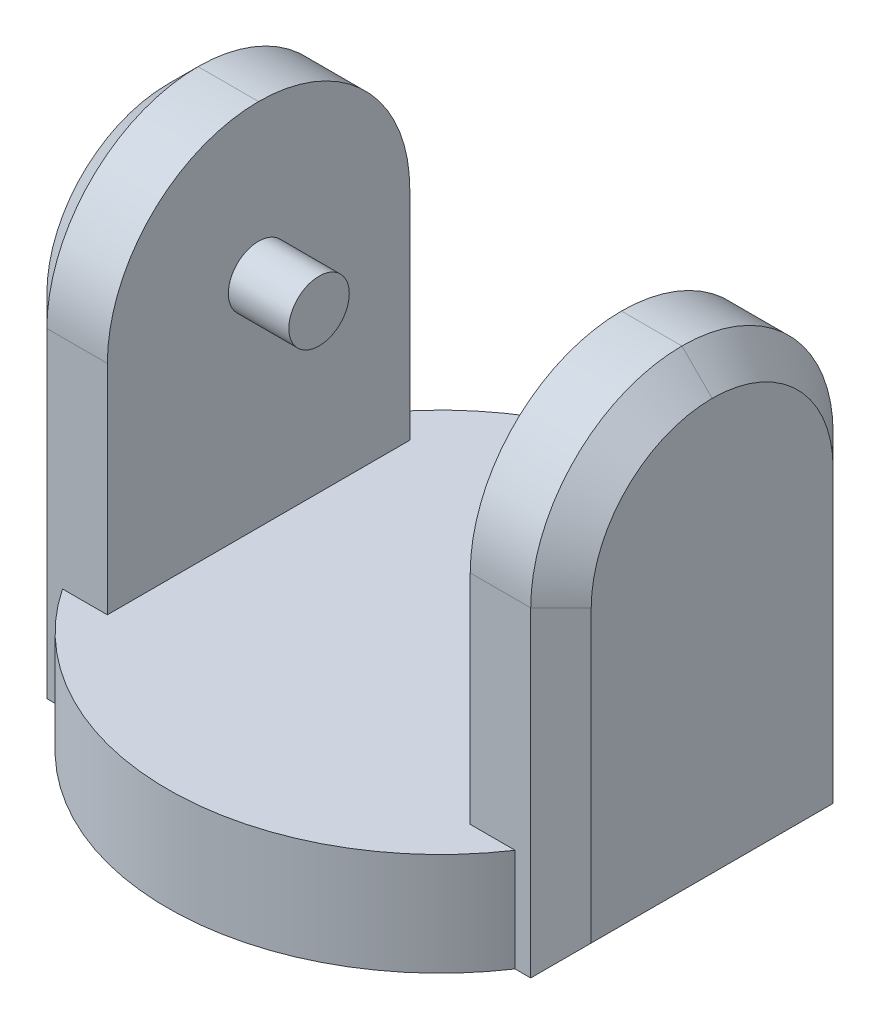
ISO-10303-21;
HEADER;
FILE_DESCRIPTION(('STEP AP214'),'2;1');
FILE_NAME('part.step','',(''),(''),'','','');
FILE_SCHEMA(('AUTOMOTIVE_DESIGN { 1 0 10303 214 1 1 1 1 }'));
ENDSEC;
DATA;
#1=APPLICATION_CONTEXT('core data for automotive mechanical design processes');
#2=APPLICATION_PROTOCOL_DEFINITION('international standard','automotive_design',2000,#1);
#3=PRODUCT_CONTEXT('',#1,'mechanical');
#4=PRODUCT('Part','Part','',(#3));
#5=PRODUCT_RELATED_PRODUCT_CATEGORY('part','',(#4));
#6=PRODUCT_DEFINITION_FORMATION('','',#4);
#7=PRODUCT_DEFINITION_CONTEXT('part definition',#1,'design');
#8=PRODUCT_DEFINITION('design','',#6,#7);
#9=PRODUCT_DEFINITION_SHAPE('','',#8);
#10=(LENGTH_UNIT() NAMED_UNIT(*) SI_UNIT(.MILLI.,.METRE.));
#11=(NAMED_UNIT(*) PLANE_ANGLE_UNIT() SI_UNIT($,.RADIAN.));
#12=(NAMED_UNIT(*) SI_UNIT($,.STERADIAN.) SOLID_ANGLE_UNIT());
#13=UNCERTAINTY_MEASURE_WITH_UNIT(LENGTH_MEASURE(1.E-05),#10,'distance_accuracy_value','');
#14=(GEOMETRIC_REPRESENTATION_CONTEXT(3) GLOBAL_UNCERTAINTY_ASSIGNED_CONTEXT((#13)) GLOBAL_UNIT_ASSIGNED_CONTEXT((#10,
#11,#12)) REPRESENTATION_CONTEXT('',''));
#15=CARTESIAN_POINT('',(0.,0.,0.));
#16=DIRECTION('',(0.,0.,1.));
#17=DIRECTION('',(1.,0.,0.));
#18=AXIS2_PLACEMENT_3D('',#15,#16,#17);
#19=CARTESIAN_POINT('',(0.,17.,0.));
#20=DIRECTION('',(0.,-1.,0.));
#21=DIRECTION('',(0.,0.,-1.));
#22=AXIS2_PLACEMENT_3D('',#19,#20,#21);
#23=CYLINDRICAL_SURFACE('',#22,45.);
#24=DIRECTION('',(0.,-1.,0.));
#25=VECTOR('',#24,1.);
#26=CARTESIAN_POINT('',(-37.4165738677394,17.,25.));
#27=LINE('',#26,#25);
#28=CARTESIAN_POINT('',(-37.4165738677394,0.,25.));
#29=VERTEX_POINT('',#28);
#30=CARTESIAN_POINT('',(-37.4165738677394,17.,25.));
#31=VERTEX_POINT('',#30);
#32=EDGE_CURVE('E205',#29,#31,#27,.F.);
#33=ORIENTED_EDGE('',*,*,#32,.F.);
#34=CARTESIAN_POINT('',(0.,0.,0.));
#35=DIRECTION('',(0.,1.,0.));
#36=DIRECTION('',(0.,0.,1.));
#37=AXIS2_PLACEMENT_3D('',#34,#35,#36);
#38=CIRCLE('',#37,45.);
#39=CARTESIAN_POINT('',(37.4165738677394,0.,25.));
#40=VERTEX_POINT('',#39);
#41=EDGE_CURVE('E231',#29,#40,#38,.T.);
#42=ORIENTED_EDGE('',*,*,#41,.T.);
#43=DIRECTION('',(0.,-1.,0.));
#44=VECTOR('',#43,1.);
#45=CARTESIAN_POINT('',(37.4165738677394,17.,25.));
#46=LINE('',#45,#44);
#47=CARTESIAN_POINT('',(37.4165738677394,17.,25.));
#48=VERTEX_POINT('',#47);
#49=EDGE_CURVE('E228',#40,#48,#46,.F.);
#50=ORIENTED_EDGE('',*,*,#49,.T.);
#51=CARTESIAN_POINT('',(0.,17.,0.));
#52=DIRECTION('',(0.,1.,0.));
#53=DIRECTION('',(0.,0.,1.));
#54=AXIS2_PLACEMENT_3D('',#51,#52,#53);
#55=CIRCLE('',#54,45.);
#56=EDGE_CURVE('E234',#31,#48,#55,.T.);
#57=ORIENTED_EDGE('',*,*,#56,.F.);
#58=EDGE_LOOP('',(#33,#42,#50,#57));
#59=FACE_BOUND('',#58,.T.);
#60=ADVANCED_FACE('F39',(#59),#23,.T.);
#61=DIRECTION('',(0.,-1.,0.));
#62=VECTOR('',#61,1.);
#63=CARTESIAN_POINT('',(-37.4165738677394,17.,-25.));
#64=LINE('',#63,#62);
#65=CARTESIAN_POINT('',(-37.4165738677394,17.,-25.));
#66=VERTEX_POINT('',#65);
#67=CARTESIAN_POINT('',(-37.4165738677394,0.,-25.));
#68=VERTEX_POINT('',#67);
#69=EDGE_CURVE('E198',#66,#68,#64,.T.);
#70=ORIENTED_EDGE('',*,*,#69,.F.);
#71=CARTESIAN_POINT('',(37.4165738677394,17.,-25.));
#72=VERTEX_POINT('',#71);
#73=EDGE_CURVE('E197',#72,#66,#55,.T.);
#74=ORIENTED_EDGE('',*,*,#73,.F.);
#75=DIRECTION('',(0.,-1.,0.));
#76=VECTOR('',#75,1.);
#77=CARTESIAN_POINT('',(37.4165738677394,17.,-25.));
#78=LINE('',#77,#76);
#79=CARTESIAN_POINT('',(37.4165738677394,0.,-25.));
#80=VERTEX_POINT('',#79);
#81=EDGE_CURVE('E223',#72,#80,#78,.T.);
#82=ORIENTED_EDGE('',*,*,#81,.T.);
#83=EDGE_CURVE('E235',#80,#68,#38,.T.);
#84=ORIENTED_EDGE('',*,*,#83,.T.);
#85=EDGE_LOOP('',(#70,#74,#82,#84));
#86=FACE_BOUND('',#85,.T.);
#87=ADVANCED_FACE('F435',(#86),#23,.T.);
#88=CARTESIAN_POINT('',(0.,17.,0.));
#89=DIRECTION('',(0.,1.,0.));
#90=DIRECTION('',(0.,0.,1.));
#91=AXIS2_PLACEMENT_3D('',#88,#89,#90);
#92=PLANE('',#91);
#93=DIRECTION('',(0.,0.,1.));
#94=VECTOR('',#93,1.);
#95=CARTESIAN_POINT('',(-30.,17.,0.));
#96=LINE('',#95,#94);
#97=CARTESIAN_POINT('',(-30.,17.,-25.));
#98=VERTEX_POINT('',#97);
#99=CARTESIAN_POINT('',(-30.,17.,25.));
#100=VERTEX_POINT('',#99);
#101=EDGE_CURVE('E172',#98,#100,#96,.T.);
#102=ORIENTED_EDGE('',*,*,#101,.T.);
#103=DIRECTION('',(-1.,0.,0.));
#104=VECTOR('',#103,1.);
#105=CARTESIAN_POINT('',(0.,17.,25.));
#106=LINE('',#105,#104);
#107=EDGE_CURVE('E200',#100,#31,#106,.T.);
#108=ORIENTED_EDGE('',*,*,#107,.T.);
#109=ORIENTED_EDGE('',*,*,#56,.T.);
#110=DIRECTION('',(1.,0.,0.));
#111=VECTOR('',#110,1.);
#112=CARTESIAN_POINT('',(0.,17.,25.));
#113=LINE('',#112,#111);
#114=CARTESIAN_POINT('',(30.,17.,25.));
#115=VERTEX_POINT('',#114);
#116=EDGE_CURVE('E225',#115,#48,#113,.T.);
#117=ORIENTED_EDGE('',*,*,#116,.F.);
#118=DIRECTION('',(0.,0.,1.));
#119=VECTOR('',#118,1.);
#120=CARTESIAN_POINT('',(30.,17.,0.));
#121=LINE('',#120,#119);
#122=CARTESIAN_POINT('',(30.,17.,-25.));
#123=VERTEX_POINT('',#122);
#124=EDGE_CURVE('E216',#123,#115,#121,.T.);
#125=ORIENTED_EDGE('',*,*,#124,.F.);
#126=DIRECTION('',(-1.,0.,0.));
#127=VECTOR('',#126,1.);
#128=CARTESIAN_POINT('',(0.,17.,-25.));
#129=LINE('',#128,#127);
#130=EDGE_CURVE('E220',#72,#123,#129,.T.);
#131=ORIENTED_EDGE('',*,*,#130,.F.);
#132=ORIENTED_EDGE('',*,*,#73,.T.);
#133=DIRECTION('',(1.,0.,0.));
#134=VECTOR('',#133,1.);
#135=CARTESIAN_POINT('',(0.,17.,-25.));
#136=LINE('',#135,#134);
#137=EDGE_CURVE('E183',#66,#98,#136,.T.);
#138=ORIENTED_EDGE('',*,*,#137,.T.);
#139=EDGE_LOOP('',(#102,#108,#109,#117,#125,#131,#132,#138));
#140=FACE_BOUND('',#139,.T.);
#141=ADVANCED_FACE('F195',(#140),#92,.T.);
#142=CARTESIAN_POINT('',(0.,0.,0.));
#143=DIRECTION('',(0.,1.,0.));
#144=DIRECTION('',(0.,0.,1.));
#145=AXIS2_PLACEMENT_3D('',#142,#143,#144);
#146=PLANE('',#145);
#147=CARTESIAN_POINT('',(0.,0.,0.));
#148=DIRECTION('',(0.,-1.,0.));
#149=DIRECTION('',(0.,0.,-1.));
#150=AXIS2_PLACEMENT_3D('',#147,#148,#149);
#151=CIRCLE('',#150,5.);
#152=CARTESIAN_POINT('',(0.,0.,-5.));
#153=VERTEX_POINT('',#152);
#154=EDGE_CURVE('E411',#153,#153,#151,.T.);
#155=ORIENTED_EDGE('',*,*,#154,.F.);
#156=EDGE_LOOP('',(#155));
#157=FACE_BOUND('',#156,.T.);
#158=DIRECTION('',(-1.,0.,0.));
#159=VECTOR('',#158,1.);
#160=CARTESIAN_POINT('',(-30.,0.,25.));
#161=LINE('',#160,#159);
#162=CARTESIAN_POINT('',(-40.,0.,25.));
#163=VERTEX_POINT('',#162);
#164=EDGE_CURVE('E184',#29,#163,#161,.T.);
#165=ORIENTED_EDGE('',*,*,#164,.T.);
#166=DIRECTION('',(0.,0.,-1.));
#167=VECTOR('',#166,1.);
#168=CARTESIAN_POINT('',(-40.,0.,-25.));
#169=LINE('',#168,#167);
#170=CARTESIAN_POINT('',(-40.,0.,-25.));
#171=VERTEX_POINT('',#170);
#172=EDGE_CURVE('E262',#163,#171,#169,.T.);
#173=ORIENTED_EDGE('',*,*,#172,.T.);
#174=DIRECTION('',(-1.,0.,0.));
#175=VECTOR('',#174,1.);
#176=CARTESIAN_POINT('',(-30.,0.,-25.));
#177=LINE('',#176,#175);
#178=EDGE_CURVE('E192',#68,#171,#177,.T.);
#179=ORIENTED_EDGE('',*,*,#178,.F.);
#180=ORIENTED_EDGE('',*,*,#83,.F.);
#181=DIRECTION('',(1.,0.,0.));
#182=VECTOR('',#181,1.);
#183=CARTESIAN_POINT('',(30.,0.,-25.));
#184=LINE('',#183,#182);
#185=CARTESIAN_POINT('',(40.,0.,-25.));
#186=VERTEX_POINT('',#185);
#187=EDGE_CURVE('E213',#80,#186,#184,.T.);
#188=ORIENTED_EDGE('',*,*,#187,.T.);
#189=DIRECTION('',(0.,0.,1.));
#190=VECTOR('',#189,1.);
#191=CARTESIAN_POINT('',(40.,0.,0.));
#192=LINE('',#191,#190);
#193=CARTESIAN_POINT('',(40.,0.,25.));
#194=VERTEX_POINT('',#193);
#195=EDGE_CURVE('E254',#186,#194,#192,.T.);
#196=ORIENTED_EDGE('',*,*,#195,.T.);
#197=DIRECTION('',(1.,0.,0.));
#198=VECTOR('',#197,1.);
#199=CARTESIAN_POINT('',(30.,0.,25.));
#200=LINE('',#199,#198);
#201=EDGE_CURVE('E212',#40,#194,#200,.T.);
#202=ORIENTED_EDGE('',*,*,#201,.F.);
#203=ORIENTED_EDGE('',*,*,#41,.F.);
#204=EDGE_LOOP('',(#165,#173,#179,#180,#188,#196,#202,#203));
#205=FACE_BOUND('',#204,.T.);
#206=ADVANCED_FACE('F361',(#157,#205),#146,.F.);
#207=CARTESIAN_POINT('',(30.,0.,25.));
#208=DIRECTION('',(0.,0.,1.));
#209=DIRECTION('',(1.,0.,0.));
#210=AXIS2_PLACEMENT_3D('',#207,#208,#209);
#211=PLANE('',#210);
#212=ORIENTED_EDGE('',*,*,#201,.T.);
#213=DIRECTION('',(0.,1.,0.));
#214=VECTOR('',#213,1.);
#215=CARTESIAN_POINT('',(40.,53.,25.));
#216=LINE('',#215,#214);
#217=CARTESIAN_POINT('',(40.,53.,25.));
#218=VERTEX_POINT('',#217);
#219=EDGE_CURVE('E48',#194,#218,#216,.T.);
#220=ORIENTED_EDGE('',*,*,#219,.T.);
#221=DIRECTION('',(1.,0.,0.));
#222=VECTOR('',#221,1.);
#223=CARTESIAN_POINT('',(30.,53.,25.));
#224=LINE('',#223,#222);
#225=CARTESIAN_POINT('',(30.,53.,25.));
#226=VERTEX_POINT('',#225);
#227=EDGE_CURVE('E244',#218,#226,#224,.F.);
#228=ORIENTED_EDGE('',*,*,#227,.T.);
#229=DIRECTION('',(0.,-1.,0.));
#230=VECTOR('',#229,1.);
#231=CARTESIAN_POINT('',(30.,0.,25.));
#232=LINE('',#231,#230);
#233=EDGE_CURVE('E207',#226,#115,#232,.T.);
#234=ORIENTED_EDGE('',*,*,#233,.T.);
#235=ORIENTED_EDGE('',*,*,#116,.T.);
#236=ORIENTED_EDGE('',*,*,#49,.F.);
#237=EDGE_LOOP('',(#212,#220,#228,#234,#235,#236));
#238=FACE_BOUND('',#237,.T.);
#239=ADVANCED_FACE('F365',(#238),#211,.T.);
#240=CARTESIAN_POINT('',(30.,0.,-25.));
#241=DIRECTION('',(0.,0.,-1.));
#242=DIRECTION('',(-1.,0.,0.));
#243=AXIS2_PLACEMENT_3D('',#240,#241,#242);
#244=PLANE('',#243);
#245=DIRECTION('',(1.,0.,0.));
#246=VECTOR('',#245,1.);
#247=CARTESIAN_POINT('',(30.,53.,-25.));
#248=LINE('',#247,#246);
#249=CARTESIAN_POINT('',(30.,53.,-25.));
#250=VERTEX_POINT('',#249);
#251=CARTESIAN_POINT('',(40.,53.,-25.));
#252=VERTEX_POINT('',#251);
#253=EDGE_CURVE('E233',#250,#252,#248,.T.);
#254=ORIENTED_EDGE('',*,*,#253,.T.);
#255=DIRECTION('',(0.,-1.,0.));
#256=VECTOR('',#255,1.);
#257=CARTESIAN_POINT('',(40.,0.,-25.));
#258=LINE('',#257,#256);
#259=EDGE_CURVE('E295',#252,#186,#258,.T.);
#260=ORIENTED_EDGE('',*,*,#259,.T.);
#261=ORIENTED_EDGE('',*,*,#187,.F.);
#262=ORIENTED_EDGE('',*,*,#81,.F.);
#263=ORIENTED_EDGE('',*,*,#130,.T.);
#264=DIRECTION('',(0.,1.,0.));
#265=VECTOR('',#264,1.);
#266=CARTESIAN_POINT('',(30.,0.,-25.));
#267=LINE('',#266,#265);
#268=EDGE_CURVE('E209',#123,#250,#267,.T.);
#269=ORIENTED_EDGE('',*,*,#268,.T.);
#270=EDGE_LOOP('',(#254,#260,#261,#262,#263,#269));
#271=FACE_BOUND('',#270,.T.);
#272=ADVANCED_FACE('F350',(#271),#244,.T.);
#273=CARTESIAN_POINT('',(30.,0.,0.));
#274=DIRECTION('',(-1.,0.,0.));
#275=DIRECTION('',(0.,0.,1.));
#276=AXIS2_PLACEMENT_3D('',#273,#274,#275);
#277=PLANE('',#276);
#278=CARTESIAN_POINT('',(30.,53.,0.));
#279=DIRECTION('',(-1.,0.,0.));
#280=DIRECTION('',(0.,0.,1.));
#281=AXIS2_PLACEMENT_3D('',#278,#279,#280);
#282=CIRCLE('',#281,25.);
#283=CARTESIAN_POINT('',(30.,78.,0.));
#284=VERTEX_POINT('',#283);
#285=EDGE_CURVE('E240',#226,#284,#282,.T.);
#286=ORIENTED_EDGE('',*,*,#285,.T.);
#287=CARTESIAN_POINT('',(30.,53.,0.));
#288=DIRECTION('',(-1.,0.,0.));
#289=DIRECTION('',(0.,0.,1.));
#290=AXIS2_PLACEMENT_3D('',#287,#288,#289);
#291=CIRCLE('',#290,25.);
#292=EDGE_CURVE('E242',#284,#250,#291,.T.);
#293=ORIENTED_EDGE('',*,*,#292,.T.);
#294=ORIENTED_EDGE('',*,*,#268,.F.);
#295=ORIENTED_EDGE('',*,*,#124,.T.);
#296=ORIENTED_EDGE('',*,*,#233,.F.);
#297=EDGE_LOOP('',(#286,#293,#294,#295,#296));
#298=FACE_BOUND('',#297,.T.);
#299=ADVANCED_FACE('F576',(#298),#277,.T.);
#300=CARTESIAN_POINT('',(45.,0.,0.));
#301=DIRECTION('',(-1.,0.,0.));
#302=DIRECTION('',(0.,0.,1.));
#303=AXIS2_PLACEMENT_3D('',#300,#301,#302);
#304=PLANE('',#303);
#305=DIRECTION('',(0.,0.,-1.));
#306=VECTOR('',#305,1.);
#307=CARTESIAN_POINT('',(45.,4.99999999999999,0.));
#308=LINE('',#307,#306);
#309=CARTESIAN_POINT('',(45.,4.99999999999999,20.));
#310=VERTEX_POINT('',#309);
#311=CARTESIAN_POINT('',(45.,4.99999999999999,-20.));
#312=VERTEX_POINT('',#311);
#313=EDGE_CURVE('E286',#310,#312,#308,.T.);
#314=ORIENTED_EDGE('',*,*,#313,.T.);
#315=DIRECTION('',(0.,1.,0.));
#316=VECTOR('',#315,1.);
#317=CARTESIAN_POINT('',(45.,53.,-20.));
#318=LINE('',#317,#316);
#319=CARTESIAN_POINT('',(45.,53.,-20.));
#320=VERTEX_POINT('',#319);
#321=EDGE_CURVE('E292',#312,#320,#318,.T.);
#322=ORIENTED_EDGE('',*,*,#321,.T.);
#323=CARTESIAN_POINT('',(45.,53.,0.));
#324=DIRECTION('',(-1.,0.,0.));
#325=DIRECTION('',(0.,0.,1.));
#326=AXIS2_PLACEMENT_3D('',#323,#324,#325);
#327=CIRCLE('',#326,20.);
#328=CARTESIAN_POINT('',(45.,73.,0.));
#329=VERTEX_POINT('',#328);
#330=EDGE_CURVE('E290',#320,#329,#327,.F.);
#331=ORIENTED_EDGE('',*,*,#330,.T.);
#332=CARTESIAN_POINT('',(45.,53.,0.));
#333=DIRECTION('',(-1.,0.,0.));
#334=DIRECTION('',(0.,0.,1.));
#335=AXIS2_PLACEMENT_3D('',#332,#333,#334);
#336=CIRCLE('',#335,20.);
#337=CARTESIAN_POINT('',(45.,53.,20.));
#338=VERTEX_POINT('',#337);
#339=EDGE_CURVE('E288',#329,#338,#336,.F.);
#340=ORIENTED_EDGE('',*,*,#339,.T.);
#341=DIRECTION('',(0.,-1.,0.));
#342=VECTOR('',#341,1.);
#343=CARTESIAN_POINT('',(45.,0.,20.));
#344=LINE('',#343,#342);
#345=EDGE_CURVE('E284',#338,#310,#344,.T.);
#346=ORIENTED_EDGE('',*,*,#345,.T.);
#347=EDGE_LOOP('',(#314,#322,#331,#340,#346));
#348=FACE_BOUND('',#347,.T.);
#349=ADVANCED_FACE('F336',(#348),#304,.F.);
#350=CARTESIAN_POINT('',(-30.,0.,25.));
#351=DIRECTION('',(0.,0.,-1.));
#352=DIRECTION('',(-1.,0.,0.));
#353=AXIS2_PLACEMENT_3D('',#350,#351,#352);
#354=PLANE('',#353);
#355=DIRECTION('',(-1.,0.,0.));
#356=VECTOR('',#355,1.);
#357=CARTESIAN_POINT('',(-30.,53.,25.));
#358=LINE('',#357,#356);
#359=CARTESIAN_POINT('',(-30.,53.,25.));
#360=VERTEX_POINT('',#359);
#361=CARTESIAN_POINT('',(-40.,53.,25.));
#362=VERTEX_POINT('',#361);
#363=EDGE_CURVE('E246',#360,#362,#358,.T.);
#364=ORIENTED_EDGE('',*,*,#363,.T.);
#365=DIRECTION('',(0.,-1.,0.));
#366=VECTOR('',#365,1.);
#367=CARTESIAN_POINT('',(-40.,0.,25.));
#368=LINE('',#367,#366);
#369=EDGE_CURVE('E278',#362,#163,#368,.T.);
#370=ORIENTED_EDGE('',*,*,#369,.T.);
#371=ORIENTED_EDGE('',*,*,#164,.F.);
#372=ORIENTED_EDGE('',*,*,#32,.T.);
#373=ORIENTED_EDGE('',*,*,#107,.F.);
#374=DIRECTION('',(0.,-1.,0.));
#375=VECTOR('',#374,1.);
#376=CARTESIAN_POINT('',(-30.,0.,25.));
#377=LINE('',#376,#375);
#378=EDGE_CURVE('E178',#360,#100,#377,.T.);
#379=ORIENTED_EDGE('',*,*,#378,.F.);
#380=EDGE_LOOP('',(#364,#370,#371,#372,#373,#379));
#381=FACE_BOUND('',#380,.T.);
#382=ADVANCED_FACE('F404',(#381),#354,.F.);
#383=CARTESIAN_POINT('',(-30.,0.,-25.));
#384=DIRECTION('',(0.,0.,1.));
#385=DIRECTION('',(1.,0.,0.));
#386=AXIS2_PLACEMENT_3D('',#383,#384,#385);
#387=PLANE('',#386);
#388=ORIENTED_EDGE('',*,*,#178,.T.);
#389=DIRECTION('',(0.,1.,0.));
#390=VECTOR('',#389,1.);
#391=CARTESIAN_POINT('',(-40.,53.,-25.));
#392=LINE('',#391,#390);
#393=CARTESIAN_POINT('',(-40.,53.,-25.));
#394=VERTEX_POINT('',#393);
#395=EDGE_CURVE('E276',#171,#394,#392,.T.);
#396=ORIENTED_EDGE('',*,*,#395,.T.);
#397=DIRECTION('',(-1.,0.,0.));
#398=VECTOR('',#397,1.);
#399=CARTESIAN_POINT('',(-30.,53.,-25.));
#400=LINE('',#399,#398);
#401=CARTESIAN_POINT('',(-30.,53.,-25.));
#402=VERTEX_POINT('',#401);
#403=EDGE_CURVE('E191',#394,#402,#400,.F.);
#404=ORIENTED_EDGE('',*,*,#403,.T.);
#405=DIRECTION('',(0.,1.,0.));
#406=VECTOR('',#405,1.);
#407=CARTESIAN_POINT('',(-30.,0.,-25.));
#408=LINE('',#407,#406);
#409=EDGE_CURVE('E175',#98,#402,#408,.T.);
#410=ORIENTED_EDGE('',*,*,#409,.F.);
#411=ORIENTED_EDGE('',*,*,#137,.F.);
#412=ORIENTED_EDGE('',*,*,#69,.T.);
#413=EDGE_LOOP('',(#388,#396,#404,#410,#411,#412));
#414=FACE_BOUND('',#413,.T.);
#415=ADVANCED_FACE('F188',(#414),#387,.F.);
#416=CARTESIAN_POINT('',(-30.,0.,0.));
#417=DIRECTION('',(-1.,0.,0.));
#418=DIRECTION('',(0.,0.,1.));
#419=AXIS2_PLACEMENT_3D('',#416,#417,#418);
#420=PLANE('',#419);
#421=CARTESIAN_POINT('',(-30.,53.,0.));
#422=DIRECTION('',(-1.,0.,0.));
#423=DIRECTION('',(0.,0.,1.));
#424=AXIS2_PLACEMENT_3D('',#421,#422,#423);
#425=CIRCLE('',#424,5.);
#426=CARTESIAN_POINT('',(-30.,53.,5.));
#427=VERTEX_POINT('',#426);
#428=EDGE_CURVE('E11',#427,#427,#425,.F.);
#429=ORIENTED_EDGE('',*,*,#428,.F.);
#430=EDGE_LOOP('',(#429));
#431=FACE_BOUND('',#430,.T.);
#432=CARTESIAN_POINT('',(-30.,53.,0.));
#433=DIRECTION('',(-1.,0.,0.));
#434=DIRECTION('',(0.,0.,1.));
#435=AXIS2_PLACEMENT_3D('',#432,#433,#434);
#436=CIRCLE('',#435,25.);
#437=CARTESIAN_POINT('',(-30.,78.,0.));
#438=VERTEX_POINT('',#437);
#439=EDGE_CURVE('E249',#402,#438,#436,.F.);
#440=ORIENTED_EDGE('',*,*,#439,.T.);
#441=CARTESIAN_POINT('',(-30.,53.,0.));
#442=DIRECTION('',(-1.,0.,0.));
#443=DIRECTION('',(0.,0.,1.));
#444=AXIS2_PLACEMENT_3D('',#441,#442,#443);
#445=CIRCLE('',#444,25.);
#446=EDGE_CURVE('E251',#438,#360,#445,.F.);
#447=ORIENTED_EDGE('',*,*,#446,.T.);
#448=ORIENTED_EDGE('',*,*,#378,.T.);
#449=ORIENTED_EDGE('',*,*,#101,.F.);
#450=ORIENTED_EDGE('',*,*,#409,.T.);
#451=EDGE_LOOP('',(#440,#447,#448,#449,#450));
#452=FACE_BOUND('',#451,.T.);
#453=ADVANCED_FACE('F174',(#431,#452),#420,.F.);
#454=CARTESIAN_POINT('',(-45.,0.,0.));
#455=DIRECTION('',(-1.,0.,0.));
#456=DIRECTION('',(0.,0.,1.));
#457=AXIS2_PLACEMENT_3D('',#454,#455,#456);
#458=PLANE('',#457);
#459=DIRECTION('',(0.,-1.,0.));
#460=VECTOR('',#459,1.);
#461=CARTESIAN_POINT('',(-45.,0.,-20.));
#462=LINE('',#461,#460);
#463=CARTESIAN_POINT('',(-45.,53.,-20.));
#464=VERTEX_POINT('',#463);
#465=CARTESIAN_POINT('',(-45.,5.,-20.));
#466=VERTEX_POINT('',#465);
#467=EDGE_CURVE('E271',#464,#466,#462,.T.);
#468=ORIENTED_EDGE('',*,*,#467,.T.);
#469=DIRECTION('',(0.,0.,1.));
#470=VECTOR('',#469,1.);
#471=CARTESIAN_POINT('',(-45.,5.,25.));
#472=LINE('',#471,#470);
#473=CARTESIAN_POINT('',(-45.,5.,20.));
#474=VERTEX_POINT('',#473);
#475=EDGE_CURVE('E273',#466,#474,#472,.T.);
#476=ORIENTED_EDGE('',*,*,#475,.T.);
#477=DIRECTION('',(0.,1.,0.));
#478=VECTOR('',#477,1.);
#479=CARTESIAN_POINT('',(-45.,53.,20.));
#480=LINE('',#479,#478);
#481=CARTESIAN_POINT('',(-45.,53.,20.));
#482=VERTEX_POINT('',#481);
#483=EDGE_CURVE('E269',#474,#482,#480,.T.);
#484=ORIENTED_EDGE('',*,*,#483,.T.);
#485=CARTESIAN_POINT('',(-45.,53.,0.));
#486=DIRECTION('',(-1.,0.,0.));
#487=DIRECTION('',(0.,0.,1.));
#488=AXIS2_PLACEMENT_3D('',#485,#486,#487);
#489=CIRCLE('',#488,20.);
#490=CARTESIAN_POINT('',(-45.,73.,0.));
#491=VERTEX_POINT('',#490);
#492=EDGE_CURVE('E265',#482,#491,#489,.T.);
#493=ORIENTED_EDGE('',*,*,#492,.T.);
#494=CARTESIAN_POINT('',(-45.,53.,0.));
#495=DIRECTION('',(-1.,0.,0.));
#496=DIRECTION('',(0.,0.,1.));
#497=AXIS2_PLACEMENT_3D('',#494,#495,#496);
#498=CIRCLE('',#497,20.);
#499=EDGE_CURVE('E267',#491,#464,#498,.T.);
#500=ORIENTED_EDGE('',*,*,#499,.T.);
#501=EDGE_LOOP('',(#468,#476,#484,#493,#500));
#502=FACE_BOUND('',#501,.T.);
#503=ADVANCED_FACE('F449',(#502),#458,.T.);
#504=CARTESIAN_POINT('',(30.,53.,0.));
#505=DIRECTION('',(1.,0.,0.));
#506=DIRECTION('',(0.,0.,-1.));
#507=AXIS2_PLACEMENT_3D('',#504,#505,#506);
#508=CYLINDRICAL_SURFACE('',#507,25.);
#509=ORIENTED_EDGE('',*,*,#227,.F.);
#510=CARTESIAN_POINT('',(40.,53.,0.));
#511=DIRECTION('',(-1.,0.,0.));
#512=DIRECTION('',(0.,0.,1.));
#513=AXIS2_PLACEMENT_3D('',#510,#511,#512);
#514=CIRCLE('',#513,25.);
#515=CARTESIAN_POINT('',(40.,78.,0.));
#516=VERTEX_POINT('',#515);
#517=EDGE_CURVE('E61',#218,#516,#514,.T.);
#518=ORIENTED_EDGE('',*,*,#517,.T.);
#519=DIRECTION('',(1.,0.,0.));
#520=VECTOR('',#519,1.);
#521=CARTESIAN_POINT('',(30.,78.,0.));
#522=LINE('',#521,#520);
#523=EDGE_CURVE('E255',#284,#516,#522,.T.);
#524=ORIENTED_EDGE('',*,*,#523,.F.);
#525=ORIENTED_EDGE('',*,*,#285,.F.);
#526=EDGE_LOOP('',(#509,#518,#524,#525));
#527=FACE_BOUND('',#526,.T.);
#528=ADVANCED_FACE('F446',(#527),#508,.T.);
#529=CARTESIAN_POINT('',(30.,53.,0.));
#530=DIRECTION('',(1.,0.,0.));
#531=DIRECTION('',(0.,0.,-1.));
#532=AXIS2_PLACEMENT_3D('',#529,#530,#531);
#533=CYLINDRICAL_SURFACE('',#532,25.);
#534=ORIENTED_EDGE('',*,*,#523,.T.);
#535=CARTESIAN_POINT('',(40.,53.,0.));
#536=DIRECTION('',(-1.,0.,0.));
#537=DIRECTION('',(0.,0.,1.));
#538=AXIS2_PLACEMENT_3D('',#535,#536,#537);
#539=CIRCLE('',#538,25.);
#540=EDGE_CURVE('E298',#516,#252,#539,.T.);
#541=ORIENTED_EDGE('',*,*,#540,.T.);
#542=ORIENTED_EDGE('',*,*,#253,.F.);
#543=ORIENTED_EDGE('',*,*,#292,.F.);
#544=EDGE_LOOP('',(#534,#541,#542,#543));
#545=FACE_BOUND('',#544,.T.);
#546=ADVANCED_FACE('F346',(#545),#533,.T.);
#547=CARTESIAN_POINT('',(-30.,53.,0.));
#548=DIRECTION('',(-1.,0.,0.));
#549=DIRECTION('',(0.,0.,1.));
#550=AXIS2_PLACEMENT_3D('',#547,#548,#549);
#551=CYLINDRICAL_SURFACE('',#550,25.);
#552=ORIENTED_EDGE('',*,*,#403,.F.);
#553=CARTESIAN_POINT('',(-40.,53.,0.));
#554=DIRECTION('',(-1.,0.,0.));
#555=DIRECTION('',(0.,0.,1.));
#556=AXIS2_PLACEMENT_3D('',#553,#554,#555);
#557=CIRCLE('',#556,25.);
#558=CARTESIAN_POINT('',(-40.,78.,0.));
#559=VERTEX_POINT('',#558);
#560=EDGE_CURVE('E280',#394,#559,#557,.F.);
#561=ORIENTED_EDGE('',*,*,#560,.T.);
#562=DIRECTION('',(-1.,0.,0.));
#563=VECTOR('',#562,1.);
#564=CARTESIAN_POINT('',(-30.,78.,0.));
#565=LINE('',#564,#563);
#566=EDGE_CURVE('E257',#438,#559,#565,.T.);
#567=ORIENTED_EDGE('',*,*,#566,.F.);
#568=ORIENTED_EDGE('',*,*,#439,.F.);
#569=EDGE_LOOP('',(#552,#561,#567,#568));
#570=FACE_BOUND('',#569,.T.);
#571=ADVANCED_FACE('F389',(#570),#551,.T.);
#572=CARTESIAN_POINT('',(-30.,53.,0.));
#573=DIRECTION('',(-1.,0.,0.));
#574=DIRECTION('',(0.,0.,1.));
#575=AXIS2_PLACEMENT_3D('',#572,#573,#574);
#576=CYLINDRICAL_SURFACE('',#575,25.);
#577=ORIENTED_EDGE('',*,*,#566,.T.);
#578=CARTESIAN_POINT('',(-40.,53.,0.));
#579=DIRECTION('',(-1.,0.,0.));
#580=DIRECTION('',(0.,0.,1.));
#581=AXIS2_PLACEMENT_3D('',#578,#579,#580);
#582=CIRCLE('',#581,25.);
#583=EDGE_CURVE('E282',#559,#362,#582,.F.);
#584=ORIENTED_EDGE('',*,*,#583,.T.);
#585=ORIENTED_EDGE('',*,*,#363,.F.);
#586=ORIENTED_EDGE('',*,*,#446,.F.);
#587=EDGE_LOOP('',(#577,#584,#585,#586));
#588=FACE_BOUND('',#587,.T.);
#589=ADVANCED_FACE('F402',(#588),#576,.T.);
#590=CARTESIAN_POINT('',(-45.,53.,0.));
#591=DIRECTION('',(1.,0.,0.));
#592=DIRECTION('',(0.,0.,-1.));
#593=AXIS2_PLACEMENT_3D('',#590,#591,#592);
#594=CONICAL_SURFACE('',#593,20.,0.785398163397445);
#595=DIRECTION('',(-0.70710678118655,0.,-0.707106781186545));
#596=VECTOR('',#595,1.);
#597=CARTESIAN_POINT('',(-40.,53.,25.));
#598=LINE('',#597,#596);
#599=EDGE_CURVE('E310',#362,#482,#598,.T.);
#600=ORIENTED_EDGE('',*,*,#599,.F.);
#601=ORIENTED_EDGE('',*,*,#583,.F.);
#602=DIRECTION('',(0.70710678118655,0.707106781186545,0.));
#603=VECTOR('',#602,1.);
#604=CARTESIAN_POINT('',(-45.,73.,0.));
#605=LINE('',#604,#603);
#606=EDGE_CURVE('E260',#491,#559,#605,.T.);
#607=ORIENTED_EDGE('',*,*,#606,.F.);
#608=ORIENTED_EDGE('',*,*,#492,.F.);
#609=EDGE_LOOP('',(#600,#601,#607,#608));
#610=FACE_BOUND('',#609,.T.);
#611=ADVANCED_FACE('F399',(#610),#594,.T.);
#612=CARTESIAN_POINT('',(-45.,53.,0.));
#613=DIRECTION('',(1.,0.,0.));
#614=DIRECTION('',(0.,0.,-1.));
#615=AXIS2_PLACEMENT_3D('',#612,#613,#614);
#616=CONICAL_SURFACE('',#615,20.,0.785398163397444);
#617=ORIENTED_EDGE('',*,*,#606,.T.);
#618=ORIENTED_EDGE('',*,*,#560,.F.);
#619=DIRECTION('',(0.70710678118655,0.,-0.707106781186545));
#620=VECTOR('',#619,1.);
#621=CARTESIAN_POINT('',(-45.,53.,-20.));
#622=LINE('',#621,#620);
#623=EDGE_CURVE('E307',#464,#394,#622,.T.);
#624=ORIENTED_EDGE('',*,*,#623,.F.);
#625=ORIENTED_EDGE('',*,*,#499,.F.);
#626=EDGE_LOOP('',(#617,#618,#624,#625));
#627=FACE_BOUND('',#626,.T.);
#628=ADVANCED_FACE('F392',(#627),#616,.T.);
#629=CARTESIAN_POINT('',(-40.,0.,25.));
#630=DIRECTION('',(-0.707106781186545,0.,0.70710678118655));
#631=DIRECTION('',(0.,1.,0.));
#632=AXIS2_PLACEMENT_3D('',#629,#630,#631);
#633=PLANE('',#632);
#634=ORIENTED_EDGE('',*,*,#599,.T.);
#635=ORIENTED_EDGE('',*,*,#483,.F.);
#636=DIRECTION('',(0.577350269189627,-0.577350269189628,0.577350269189622));
#637=VECTOR('',#636,1.);
#638=CARTESIAN_POINT('',(-40.,0.,25.));
#639=LINE('',#638,#637);
#640=EDGE_CURVE('E304',#163,#474,#639,.F.);
#641=ORIENTED_EDGE('',*,*,#640,.F.);
#642=ORIENTED_EDGE('',*,*,#369,.F.);
#643=EDGE_LOOP('',(#634,#635,#641,#642));
#644=FACE_BOUND('',#643,.T.);
#645=ADVANCED_FACE('F377',(#644),#633,.T.);
#646=CARTESIAN_POINT('',(-40.,0.,-25.));
#647=DIRECTION('',(-0.707106781186545,0.,-0.70710678118655));
#648=DIRECTION('',(0.,-1.,0.));
#649=AXIS2_PLACEMENT_3D('',#646,#647,#648);
#650=PLANE('',#649);
#651=ORIENTED_EDGE('',*,*,#623,.T.);
#652=ORIENTED_EDGE('',*,*,#395,.F.);
#653=DIRECTION('',(-0.577350269189627,0.577350269189628,0.577350269189622));
#654=VECTOR('',#653,1.);
#655=CARTESIAN_POINT('',(-40.,0.,-25.));
#656=LINE('',#655,#654);
#657=EDGE_CURVE('E302',#466,#171,#656,.F.);
#658=ORIENTED_EDGE('',*,*,#657,.F.);
#659=ORIENTED_EDGE('',*,*,#467,.F.);
#660=EDGE_LOOP('',(#651,#652,#658,#659));
#661=FACE_BOUND('',#660,.T.);
#662=ADVANCED_FACE('F385',(#661),#650,.T.);
#663=CARTESIAN_POINT('',(-40.,0.,0.));
#664=DIRECTION('',(-0.707106781186548,-0.707106781186546,0.));
#665=DIRECTION('',(0.,0.,1.));
#666=AXIS2_PLACEMENT_3D('',#663,#664,#665);
#667=PLANE('',#666);
#668=ORIENTED_EDGE('',*,*,#640,.T.);
#669=ORIENTED_EDGE('',*,*,#475,.F.);
#670=ORIENTED_EDGE('',*,*,#657,.T.);
#671=ORIENTED_EDGE('',*,*,#172,.F.);
#672=EDGE_LOOP('',(#668,#669,#670,#671));
#673=FACE_BOUND('',#672,.T.);
#674=ADVANCED_FACE('F380',(#673),#667,.T.);
#675=CARTESIAN_POINT('',(45.,0.,20.));
#676=DIRECTION('',(0.707106781186545,0.,0.707106781186549));
#677=DIRECTION('',(0.,1.,0.));
#678=AXIS2_PLACEMENT_3D('',#675,#676,#677);
#679=PLANE('',#678);
#680=DIRECTION('',(-0.577350269189628,-0.577350269189625,0.577350269189625));
#681=VECTOR('',#680,1.);
#682=CARTESIAN_POINT('',(43.3333333333333,3.33333333333333,21.6666666666667));
#683=LINE('',#682,#681);
#684=EDGE_CURVE('E323',#310,#194,#683,.T.);
#685=ORIENTED_EDGE('',*,*,#684,.F.);
#686=ORIENTED_EDGE('',*,*,#345,.F.);
#687=DIRECTION('',(0.707106781186549,0.,-0.707106781186545));
#688=VECTOR('',#687,1.);
#689=CARTESIAN_POINT('',(40.,53.,25.));
#690=LINE('',#689,#688);
#691=EDGE_CURVE('E305',#218,#338,#690,.T.);
#692=ORIENTED_EDGE('',*,*,#691,.F.);
#693=ORIENTED_EDGE('',*,*,#219,.F.);
#694=EDGE_LOOP('',(#685,#686,#692,#693));
#695=FACE_BOUND('',#694,.T.);
#696=ADVANCED_FACE('F42',(#695),#679,.T.);
#697=CARTESIAN_POINT('',(45.,53.,0.));
#698=DIRECTION('',(-1.,0.,0.));
#699=DIRECTION('',(0.,0.,1.));
#700=AXIS2_PLACEMENT_3D('',#697,#698,#699);
#701=CONICAL_SURFACE('',#700,20.,0.785398163397446);
#702=ORIENTED_EDGE('',*,*,#691,.T.);
#703=ORIENTED_EDGE('',*,*,#339,.F.);
#704=DIRECTION('',(0.707106781186549,-0.707106781186545,0.));
#705=VECTOR('',#704,1.);
#706=CARTESIAN_POINT('',(40.,78.,0.));
#707=LINE('',#706,#705);
#708=EDGE_CURVE('E320',#516,#329,#707,.T.);
#709=ORIENTED_EDGE('',*,*,#708,.F.);
#710=ORIENTED_EDGE('',*,*,#517,.F.);
#711=EDGE_LOOP('',(#702,#703,#709,#710));
#712=FACE_BOUND('',#711,.T.);
#713=ADVANCED_FACE('F329',(#712),#701,.T.);
#714=CARTESIAN_POINT('',(45.,4.99999999999999,0.));
#715=DIRECTION('',(-0.707106781186545,0.707106781186549,0.));
#716=DIRECTION('',(0.,0.,-1.));
#717=AXIS2_PLACEMENT_3D('',#714,#715,#716);
#718=PLANE('',#717);
#719=ORIENTED_EDGE('',*,*,#684,.T.);
#720=ORIENTED_EDGE('',*,*,#195,.F.);
#721=DIRECTION('',(-0.577350269189628,-0.577350269189625,-0.577350269189625));
#722=VECTOR('',#721,1.);
#723=CARTESIAN_POINT('',(51.6666666666667,11.6666666666666,-13.3333333333334));
#724=LINE('',#723,#722);
#725=EDGE_CURVE('E317',#312,#186,#724,.T.);
#726=ORIENTED_EDGE('',*,*,#725,.F.);
#727=ORIENTED_EDGE('',*,*,#313,.F.);
#728=EDGE_LOOP('',(#719,#720,#726,#727));
#729=FACE_BOUND('',#728,.T.);
#730=ADVANCED_FACE('F357',(#729),#718,.F.);
#731=CARTESIAN_POINT('',(45.,53.,0.));
#732=DIRECTION('',(-1.,0.,0.));
#733=DIRECTION('',(0.,0.,1.));
#734=AXIS2_PLACEMENT_3D('',#731,#732,#733);
#735=CONICAL_SURFACE('',#734,20.,0.785398163397446);
#736=ORIENTED_EDGE('',*,*,#708,.T.);
#737=ORIENTED_EDGE('',*,*,#330,.F.);
#738=DIRECTION('',(0.707106781186549,0.,0.707106781186545));
#739=VECTOR('',#738,1.);
#740=CARTESIAN_POINT('',(40.,53.,-25.));
#741=LINE('',#740,#739);
#742=EDGE_CURVE('E315',#252,#320,#741,.T.);
#743=ORIENTED_EDGE('',*,*,#742,.F.);
#744=ORIENTED_EDGE('',*,*,#540,.F.);
#745=EDGE_LOOP('',(#736,#737,#743,#744));
#746=FACE_BOUND('',#745,.T.);
#747=ADVANCED_FACE('F342',(#746),#735,.T.);
#748=CARTESIAN_POINT('',(45.,0.,-20.));
#749=DIRECTION('',(0.707106781186545,0.,-0.707106781186549));
#750=DIRECTION('',(0.,-1.,0.));
#751=AXIS2_PLACEMENT_3D('',#748,#749,#750);
#752=PLANE('',#751);
#753=ORIENTED_EDGE('',*,*,#725,.T.);
#754=ORIENTED_EDGE('',*,*,#259,.F.);
#755=ORIENTED_EDGE('',*,*,#742,.T.);
#756=ORIENTED_EDGE('',*,*,#321,.F.);
#757=EDGE_LOOP('',(#753,#754,#755,#756));
#758=FACE_BOUND('',#757,.T.);
#759=ADVANCED_FACE('F354',(#758),#752,.T.);
#760=CARTESIAN_POINT('',(-20.,53.,0.));
#761=DIRECTION('',(-1.,0.,0.));
#762=DIRECTION('',(0.,0.,1.));
#763=AXIS2_PLACEMENT_3D('',#760,#761,#762);
#764=CYLINDRICAL_SURFACE('',#763,5.);
#765=CARTESIAN_POINT('',(-20.,53.,0.));
#766=DIRECTION('',(1.,0.,0.));
#767=DIRECTION('',(0.,0.,-1.));
#768=AXIS2_PLACEMENT_3D('',#765,#766,#767);
#769=CIRCLE('',#768,5.);
#770=CARTESIAN_POINT('',(-20.,53.,-5.));
#771=VERTEX_POINT('',#770);
#772=EDGE_CURVE('E318',#771,#771,#769,.T.);
#773=ORIENTED_EDGE('',*,*,#772,.F.);
#774=EDGE_LOOP('',(#773));
#775=FACE_BOUND('',#774,.T.);
#776=ORIENTED_EDGE('',*,*,#428,.T.);
#777=EDGE_LOOP('',(#776));
#778=FACE_BOUND('',#777,.T.);
#779=ADVANCED_FACE('F485',(#775,#778),#764,.T.);
#780=CARTESIAN_POINT('',(-20.,53.,0.));
#781=DIRECTION('',(1.,0.,0.));
#782=DIRECTION('',(0.,0.,-1.));
#783=AXIS2_PLACEMENT_3D('',#780,#781,#782);
#784=PLANE('',#783);
#785=ORIENTED_EDGE('',*,*,#772,.T.);
#786=EDGE_LOOP('',(#785));
#787=FACE_BOUND('',#786,.T.);
#788=ADVANCED_FACE('F422',(#787),#784,.T.);
#789=CARTESIAN_POINT('',(0.,10.,0.));
#790=DIRECTION('',(0.,-1.,0.));
#791=DIRECTION('',(0.,0.,-1.));
#792=AXIS2_PLACEMENT_3D('',#789,#790,#791);
#793=CYLINDRICAL_SURFACE('',#792,5.);
#794=CARTESIAN_POINT('',(0.,10.,0.));
#795=DIRECTION('',(0.,-1.,0.));
#796=DIRECTION('',(0.,0.,-1.));
#797=AXIS2_PLACEMENT_3D('',#794,#795,#796);
#798=CIRCLE('',#797,5.);
#799=CARTESIAN_POINT('',(0.,10.,-5.));
#800=VERTEX_POINT('',#799);
#801=EDGE_CURVE('E410',#800,#800,#798,.T.);
#802=ORIENTED_EDGE('',*,*,#801,.F.);
#803=EDGE_LOOP('',(#802));
#804=FACE_BOUND('',#803,.T.);
#805=ORIENTED_EDGE('',*,*,#154,.T.);
#806=EDGE_LOOP('',(#805));
#807=FACE_BOUND('',#806,.T.);
#808=ADVANCED_FACE('F419',(#804,#807),#793,.F.);
#809=CARTESIAN_POINT('',(0.,10.,0.));
#810=DIRECTION('',(0.,-1.,0.));
#811=DIRECTION('',(0.,0.,-1.));
#812=AXIS2_PLACEMENT_3D('',#809,#810,#811);
#813=PLANE('',#812);
#814=ORIENTED_EDGE('',*,*,#801,.T.);
#815=EDGE_LOOP('',(#814));
#816=FACE_BOUND('',#815,.T.);
#817=ADVANCED_FACE('F417',(#816),#813,.T.);
#818=CLOSED_SHELL('',(#60,#87,#141,#206,#239,#272,#299,#349,#382,#415,#453,#503,#528,#546,#571,
#589,#611,#628,#645,#662,#674,#696,#713,#730,#747,#759,#779,#788,#808,#817));
#819=MANIFOLD_SOLID_BREP('B2',#818);
#820=ADVANCED_BREP_SHAPE_REPRESENTATION('',(#18,#819),#14);
#821=SHAPE_DEFINITION_REPRESENTATION(#9,#820);
ENDSEC;
END-ISO-10303-21;
